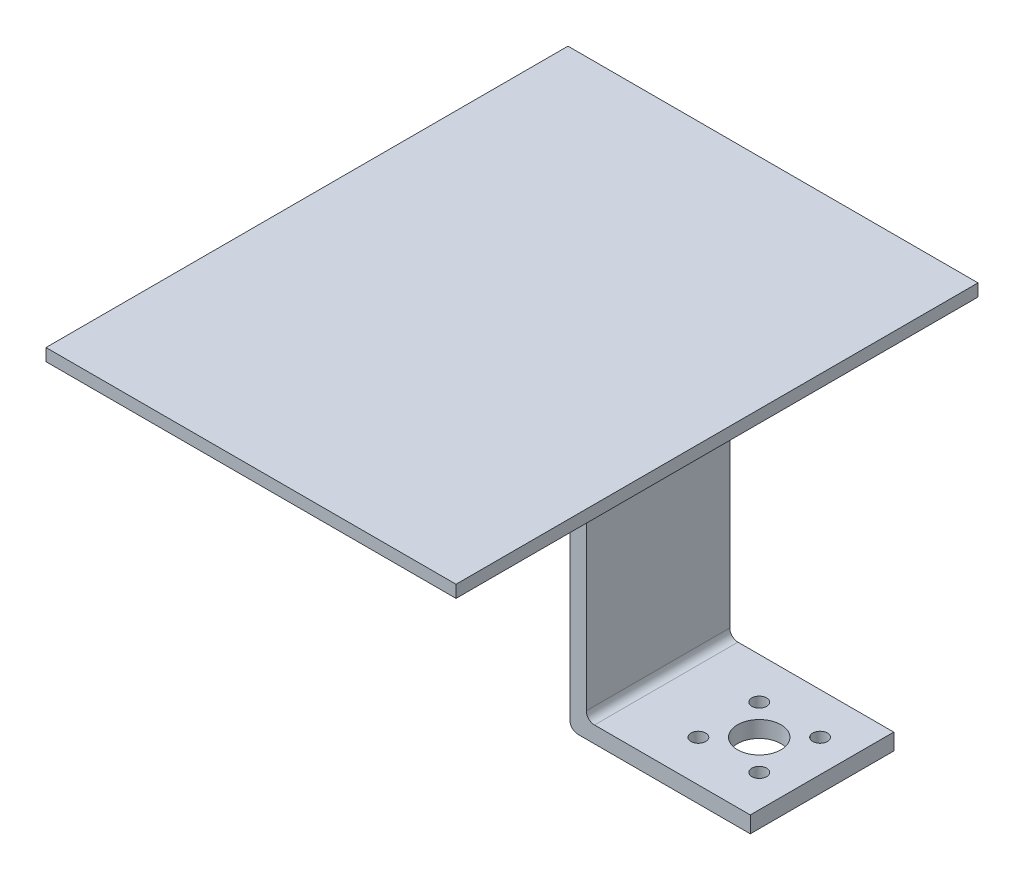
ISO-10303-21;
HEADER;
FILE_DESCRIPTION(('STEP AP214'),'2;1');
FILE_NAME('part.step','',(''),(''),'','','');
FILE_SCHEMA(('AUTOMOTIVE_DESIGN { 1 0 10303 214 1 1 1 1 }'));
ENDSEC;
DATA;
#1=APPLICATION_CONTEXT('core data for automotive mechanical design processes');
#2=APPLICATION_PROTOCOL_DEFINITION('international standard','automotive_design',2000,#1);
#3=PRODUCT_CONTEXT('',#1,'mechanical');
#4=PRODUCT('Part','Part','',(#3));
#5=PRODUCT_RELATED_PRODUCT_CATEGORY('part','',(#4));
#6=PRODUCT_DEFINITION_FORMATION('','',#4);
#7=PRODUCT_DEFINITION_CONTEXT('part definition',#1,'design');
#8=PRODUCT_DEFINITION('design','',#6,#7);
#9=PRODUCT_DEFINITION_SHAPE('','',#8);
#10=(LENGTH_UNIT() NAMED_UNIT(*) SI_UNIT(.MILLI.,.METRE.));
#11=(NAMED_UNIT(*) PLANE_ANGLE_UNIT() SI_UNIT($,.RADIAN.));
#12=(NAMED_UNIT(*) SI_UNIT($,.STERADIAN.) SOLID_ANGLE_UNIT());
#13=UNCERTAINTY_MEASURE_WITH_UNIT(LENGTH_MEASURE(1.E-05),#10,'distance_accuracy_value','');
#14=(GEOMETRIC_REPRESENTATION_CONTEXT(3) GLOBAL_UNCERTAINTY_ASSIGNED_CONTEXT((#13)) GLOBAL_UNIT_ASSIGNED_CONTEXT((#10,
#11,#12)) REPRESENTATION_CONTEXT('',''));
#15=CARTESIAN_POINT('',(0.,0.,0.));
#16=DIRECTION('',(0.,0.,1.));
#17=DIRECTION('',(1.,0.,0.));
#18=AXIS2_PLACEMENT_3D('',#15,#16,#17);
#19=CARTESIAN_POINT('',(35.6108399779155,-60.,17.4962251040256));
#20=DIRECTION('',(-1.,0.,0.));
#21=DIRECTION('',(0.,0.,1.));
#22=AXIS2_PLACEMENT_3D('',#19,#20,#21);
#23=PLANE('',#22);
#24=DIRECTION('',(0.,1.,0.));
#25=VECTOR('',#24,1.);
#26=CARTESIAN_POINT('',(35.6108399779155,-60.,17.4962251040256));
#27=LINE('',#26,#25);
#28=CARTESIAN_POINT('',(35.6108399779155,-54.,17.4962251040256));
#29=VERTEX_POINT('',#28);
#30=CARTESIAN_POINT('',(35.6108399779155,0.,17.4962251040256));
#31=VERTEX_POINT('',#30);
#32=EDGE_CURVE('E183',#29,#31,#27,.T.);
#33=ORIENTED_EDGE('',*,*,#32,.F.);
#34=DIRECTION('',(0.,0.,1.));
#35=VECTOR('',#34,1.);
#36=CARTESIAN_POINT('',(35.6108399779155,-54.,-17.4962251040256));
#37=LINE('',#36,#35);
#38=CARTESIAN_POINT('',(35.6108399779155,-54.,-17.4962251040256));
#39=VERTEX_POINT('',#38);
#40=EDGE_CURVE('E230',#29,#39,#37,.F.);
#41=ORIENTED_EDGE('',*,*,#40,.T.);
#42=DIRECTION('',(0.,1.,0.));
#43=VECTOR('',#42,1.);
#44=CARTESIAN_POINT('',(35.6108399779155,-60.,-17.4962251040256));
#45=LINE('',#44,#43);
#46=CARTESIAN_POINT('',(35.6108399779155,0.,-17.4962251040256));
#47=VERTEX_POINT('',#46);
#48=EDGE_CURVE('E171',#39,#47,#45,.T.);
#49=ORIENTED_EDGE('',*,*,#48,.T.);
#50=DIRECTION('',(0.,0.,1.));
#51=VECTOR('',#50,1.);
#52=CARTESIAN_POINT('',(35.6108399779155,0.,17.4962251040256));
#53=LINE('',#52,#51);
#54=EDGE_CURVE('E168',#47,#31,#53,.T.);
#55=ORIENTED_EDGE('',*,*,#54,.T.);
#56=EDGE_LOOP('',(#33,#41,#49,#55));
#57=FACE_BOUND('',#56,.T.);
#58=ADVANCED_FACE('F33',(#57),#23,.F.);
#59=CARTESIAN_POINT('',(0.,0.,0.));
#60=DIRECTION('',(0.,1.,0.));
#61=DIRECTION('',(0.,0.,1.));
#62=AXIS2_PLACEMENT_3D('',#59,#60,#61);
#63=PLANE('',#62);
#64=DIRECTION('',(0.,0.,-1.));
#65=VECTOR('',#64,1.);
#66=CARTESIAN_POINT('',(50.,0.,-63.6523764971984));
#67=LINE('',#66,#65);
#68=CARTESIAN_POINT('',(50.,0.,63.6523764971983));
#69=VERTEX_POINT('',#68);
#70=CARTESIAN_POINT('',(50.,0.,-63.6523764971984));
#71=VERTEX_POINT('',#70);
#72=EDGE_CURVE('E185',#69,#71,#67,.T.);
#73=ORIENTED_EDGE('',*,*,#72,.F.);
#74=DIRECTION('',(1.,0.,0.));
#75=VECTOR('',#74,1.);
#76=CARTESIAN_POINT('',(-50.,0.,63.6523764971983));
#77=LINE('',#76,#75);
#78=CARTESIAN_POINT('',(-50.,0.,63.6523764971983));
#79=VERTEX_POINT('',#78);
#80=EDGE_CURVE('E190',#79,#69,#77,.T.);
#81=ORIENTED_EDGE('',*,*,#80,.F.);
#82=DIRECTION('',(0.,0.,1.));
#83=VECTOR('',#82,1.);
#84=CARTESIAN_POINT('',(-50.,0.,-63.6523764971984));
#85=LINE('',#84,#83);
#86=CARTESIAN_POINT('',(-50.,0.,-63.6523764971984));
#87=VERTEX_POINT('',#86);
#88=EDGE_CURVE('E201',#87,#79,#85,.T.);
#89=ORIENTED_EDGE('',*,*,#88,.F.);
#90=DIRECTION('',(-1.,0.,0.));
#91=VECTOR('',#90,1.);
#92=CARTESIAN_POINT('',(-50.,0.,-63.6523764971984));
#93=LINE('',#92,#91);
#94=EDGE_CURVE('E199',#71,#87,#93,.T.);
#95=ORIENTED_EDGE('',*,*,#94,.F.);
#96=EDGE_LOOP('',(#73,#81,#89,#95));
#97=FACE_BOUND('',#96,.T.);
#98=DIRECTION('',(1.,0.,0.));
#99=VECTOR('',#98,1.);
#100=CARTESIAN_POINT('',(35.6108399779155,0.,-17.4962251040256));
#101=LINE('',#100,#99);
#102=CARTESIAN_POINT('',(21.6108399779155,0.,-17.4962251040256));
#103=VERTEX_POINT('',#102);
#104=EDGE_CURVE('E141',#103,#47,#101,.T.);
#105=ORIENTED_EDGE('',*,*,#104,.F.);
#106=DIRECTION('',(0.,0.,1.));
#107=VECTOR('',#106,1.);
#108=CARTESIAN_POINT('',(21.6108399779155,0.,17.4962251040256));
#109=LINE('',#108,#107);
#110=CARTESIAN_POINT('',(21.6108399779155,0.,17.4962251040256));
#111=VERTEX_POINT('',#110);
#112=EDGE_CURVE('E218',#103,#111,#109,.T.);
#113=ORIENTED_EDGE('',*,*,#112,.T.);
#114=DIRECTION('',(-1.,0.,0.));
#115=VECTOR('',#114,1.);
#116=CARTESIAN_POINT('',(35.6108399779155,0.,17.4962251040256));
#117=LINE('',#116,#115);
#118=EDGE_CURVE('E174',#31,#111,#117,.T.);
#119=ORIENTED_EDGE('',*,*,#118,.F.);
#120=ORIENTED_EDGE('',*,*,#54,.F.);
#121=EDGE_LOOP('',(#105,#113,#119,#120));
#122=FACE_BOUND('',#121,.T.);
#123=ADVANCED_FACE('F296',(#97,#122),#63,.F.);
#124=CARTESIAN_POINT('',(50.,3.,-63.6523764971984));
#125=DIRECTION('',(-1.,0.,0.));
#126=DIRECTION('',(0.,0.,1.));
#127=AXIS2_PLACEMENT_3D('',#124,#125,#126);
#128=PLANE('',#127);
#129=ORIENTED_EDGE('',*,*,#72,.T.);
#130=DIRECTION('',(0.,-1.,0.));
#131=VECTOR('',#130,1.);
#132=CARTESIAN_POINT('',(50.,3.,-63.6523764971984));
#133=LINE('',#132,#131);
#134=CARTESIAN_POINT('',(50.,3.,-63.6523764971984));
#135=VERTEX_POINT('',#134);
#136=EDGE_CURVE('E212',#135,#71,#133,.T.);
#137=ORIENTED_EDGE('',*,*,#136,.F.);
#138=DIRECTION('',(0.,0.,-1.));
#139=VECTOR('',#138,1.);
#140=CARTESIAN_POINT('',(50.,3.,-63.6523764971984));
#141=LINE('',#140,#139);
#142=CARTESIAN_POINT('',(50.,3.,63.6523764971983));
#143=VERTEX_POINT('',#142);
#144=EDGE_CURVE('E186',#143,#135,#141,.T.);
#145=ORIENTED_EDGE('',*,*,#144,.F.);
#146=DIRECTION('',(0.,-1.,0.));
#147=VECTOR('',#146,1.);
#148=CARTESIAN_POINT('',(50.,3.,63.6523764971983));
#149=LINE('',#148,#147);
#150=EDGE_CURVE('E196',#143,#69,#149,.T.);
#151=ORIENTED_EDGE('',*,*,#150,.T.);
#152=EDGE_LOOP('',(#129,#137,#145,#151));
#153=FACE_BOUND('',#152,.T.);
#154=ADVANCED_FACE('F313',(#153),#128,.F.);
#155=CARTESIAN_POINT('',(-50.,3.,-63.6523764971984));
#156=DIRECTION('',(0.,0.,1.));
#157=DIRECTION('',(1.,0.,0.));
#158=AXIS2_PLACEMENT_3D('',#155,#156,#157);
#159=PLANE('',#158);
#160=ORIENTED_EDGE('',*,*,#94,.T.);
#161=DIRECTION('',(0.,-1.,0.));
#162=VECTOR('',#161,1.);
#163=CARTESIAN_POINT('',(-50.,3.,-63.6523764971984));
#164=LINE('',#163,#162);
#165=CARTESIAN_POINT('',(-50.,3.,-63.6523764971984));
#166=VERTEX_POINT('',#165);
#167=EDGE_CURVE('E209',#166,#87,#164,.T.);
#168=ORIENTED_EDGE('',*,*,#167,.F.);
#169=DIRECTION('',(-1.,0.,0.));
#170=VECTOR('',#169,1.);
#171=CARTESIAN_POINT('',(-50.,3.,-63.6523764971984));
#172=LINE('',#171,#170);
#173=EDGE_CURVE('E189',#135,#166,#172,.T.);
#174=ORIENTED_EDGE('',*,*,#173,.F.);
#175=ORIENTED_EDGE('',*,*,#136,.T.);
#176=EDGE_LOOP('',(#160,#168,#174,#175));
#177=FACE_BOUND('',#176,.T.);
#178=ADVANCED_FACE('F330',(#177),#159,.F.);
#179=CARTESIAN_POINT('',(-50.,3.,-63.6523764971984));
#180=DIRECTION('',(1.,0.,0.));
#181=DIRECTION('',(0.,0.,-1.));
#182=AXIS2_PLACEMENT_3D('',#179,#180,#181);
#183=PLANE('',#182);
#184=ORIENTED_EDGE('',*,*,#88,.T.);
#185=DIRECTION('',(0.,-1.,0.));
#186=VECTOR('',#185,1.);
#187=CARTESIAN_POINT('',(-50.,3.,63.6523764971983));
#188=LINE('',#187,#186);
#189=CARTESIAN_POINT('',(-50.,3.,63.6523764971983));
#190=VERTEX_POINT('',#189);
#191=EDGE_CURVE('E206',#190,#79,#188,.T.);
#192=ORIENTED_EDGE('',*,*,#191,.F.);
#193=DIRECTION('',(0.,0.,1.));
#194=VECTOR('',#193,1.);
#195=CARTESIAN_POINT('',(-50.,3.,-63.6523764971984));
#196=LINE('',#195,#194);
#197=EDGE_CURVE('E192',#166,#190,#196,.T.);
#198=ORIENTED_EDGE('',*,*,#197,.F.);
#199=ORIENTED_EDGE('',*,*,#167,.T.);
#200=EDGE_LOOP('',(#184,#192,#198,#199));
#201=FACE_BOUND('',#200,.T.);
#202=ADVANCED_FACE('F326',(#201),#183,.F.);
#203=CARTESIAN_POINT('',(-50.,3.,63.6523764971983));
#204=DIRECTION('',(0.,0.,-1.));
#205=DIRECTION('',(-1.,0.,0.));
#206=AXIS2_PLACEMENT_3D('',#203,#204,#205);
#207=PLANE('',#206);
#208=ORIENTED_EDGE('',*,*,#80,.T.);
#209=ORIENTED_EDGE('',*,*,#150,.F.);
#210=DIRECTION('',(1.,0.,0.));
#211=VECTOR('',#210,1.);
#212=CARTESIAN_POINT('',(-50.,3.,63.6523764971983));
#213=LINE('',#212,#211);
#214=EDGE_CURVE('E194',#190,#143,#213,.T.);
#215=ORIENTED_EDGE('',*,*,#214,.F.);
#216=ORIENTED_EDGE('',*,*,#191,.T.);
#217=EDGE_LOOP('',(#208,#209,#215,#216));
#218=FACE_BOUND('',#217,.T.);
#219=ADVANCED_FACE('F321',(#218),#207,.F.);
#220=CARTESIAN_POINT('',(0.,3.,0.));
#221=DIRECTION('',(0.,1.,0.));
#222=DIRECTION('',(0.,0.,1.));
#223=AXIS2_PLACEMENT_3D('',#220,#221,#222);
#224=PLANE('',#223);
#225=ORIENTED_EDGE('',*,*,#144,.T.);
#226=ORIENTED_EDGE('',*,*,#173,.T.);
#227=ORIENTED_EDGE('',*,*,#197,.T.);
#228=ORIENTED_EDGE('',*,*,#214,.T.);
#229=EDGE_LOOP('',(#225,#226,#227,#228));
#230=FACE_BOUND('',#229,.T.);
#231=ADVANCED_FACE('F319',(#230),#224,.T.);
#232=CARTESIAN_POINT('',(35.6108399779155,-60.,17.4962251040256));
#233=DIRECTION('',(0.,0.,-1.));
#234=DIRECTION('',(-1.,0.,0.));
#235=AXIS2_PLACEMENT_3D('',#232,#233,#234);
#236=PLANE('',#235);
#237=DIRECTION('',(0.,1.,0.));
#238=VECTOR('',#237,1.);
#239=CARTESIAN_POINT('',(31.6108399779155,-60.,17.4962251040256));
#240=LINE('',#239,#238);
#241=CARTESIAN_POINT('',(31.6108399779155,-58.,17.4962251040256));
#242=VERTEX_POINT('',#241);
#243=CARTESIAN_POINT('',(31.6108399779155,-10.0000000000001,17.4962251040256));
#244=VERTEX_POINT('',#243);
#245=EDGE_CURVE('E181',#242,#244,#240,.T.);
#246=ORIENTED_EDGE('',*,*,#245,.F.);
#247=CARTESIAN_POINT('',(33.6108399779155,-58.,17.4962251040256));
#248=DIRECTION('',(0.,0.,-1.));
#249=DIRECTION('',(-1.,0.,0.));
#250=AXIS2_PLACEMENT_3D('',#247,#248,#249);
#251=CIRCLE('',#250,2.);
#252=CARTESIAN_POINT('',(33.6108399779155,-60.,17.4962251040256));
#253=VERTEX_POINT('',#252);
#254=EDGE_CURVE('E136',#242,#253,#251,.F.);
#255=ORIENTED_EDGE('',*,*,#254,.T.);
#256=DIRECTION('',(-1.,0.,0.));
#257=VECTOR('',#256,1.);
#258=CARTESIAN_POINT('',(35.6108399779155,-60.,17.4962251040256));
#259=LINE('',#258,#257);
#260=CARTESIAN_POINT('',(75.6108399779155,-60.,17.4962251040256));
#261=VERTEX_POINT('',#260);
#262=EDGE_CURVE('E129',#261,#253,#259,.T.);
#263=ORIENTED_EDGE('',*,*,#262,.F.);
#264=DIRECTION('',(0.,-1.,0.));
#265=VECTOR('',#264,1.);
#266=CARTESIAN_POINT('',(75.6108399779155,-60.,17.4962251040256));
#267=LINE('',#266,#265);
#268=CARTESIAN_POINT('',(75.6108399779155,-56.,17.4962251040256));
#269=VERTEX_POINT('',#268);
#270=EDGE_CURVE('E134',#269,#261,#267,.T.);
#271=ORIENTED_EDGE('',*,*,#270,.F.);
#272=DIRECTION('',(-1.,0.,0.));
#273=VECTOR('',#272,1.);
#274=CARTESIAN_POINT('',(75.6108399779155,-56.,17.4962251040256));
#275=LINE('',#274,#273);
#276=CARTESIAN_POINT('',(37.6108399779155,-56.,17.4962251040256));
#277=VERTEX_POINT('',#276);
#278=EDGE_CURVE('E164',#269,#277,#275,.T.);
#279=ORIENTED_EDGE('',*,*,#278,.T.);
#280=CARTESIAN_POINT('',(37.6108399779155,-54.,17.4962251040256));
#281=DIRECTION('',(0.,0.,-1.));
#282=DIRECTION('',(-1.,0.,0.));
#283=AXIS2_PLACEMENT_3D('',#280,#281,#282);
#284=CIRCLE('',#283,2.);
#285=EDGE_CURVE('E42',#277,#29,#284,.T.);
#286=ORIENTED_EDGE('',*,*,#285,.T.);
#287=ORIENTED_EDGE('',*,*,#32,.T.);
#288=ORIENTED_EDGE('',*,*,#118,.T.);
#289=DIRECTION('',(-0.707106781186544,0.707106781186551,0.));
#290=VECTOR('',#289,1.);
#291=CARTESIAN_POINT('',(58.6108399779154,-37.0000000000003,17.4962251040256));
#292=LINE('',#291,#290);
#293=EDGE_CURVE('E224',#111,#244,#292,.F.);
#294=ORIENTED_EDGE('',*,*,#293,.T.);
#295=EDGE_LOOP('',(#246,#255,#263,#271,#279,#286,#287,#288,#294));
#296=FACE_BOUND('',#295,.T.);
#297=ADVANCED_FACE('F131',(#296),#236,.F.);
#298=CARTESIAN_POINT('',(31.6108399779155,-60.,17.4962251040256));
#299=DIRECTION('',(1.,0.,0.));
#300=DIRECTION('',(0.,0.,-1.));
#301=AXIS2_PLACEMENT_3D('',#298,#299,#300);
#302=PLANE('',#301);
#303=DIRECTION('',(0.,1.,0.));
#304=VECTOR('',#303,1.);
#305=CARTESIAN_POINT('',(31.6108399779155,-60.,-17.4962251040256));
#306=LINE('',#305,#304);
#307=CARTESIAN_POINT('',(31.6108399779155,-58.,-17.4962251040256));
#308=VERTEX_POINT('',#307);
#309=CARTESIAN_POINT('',(31.6108399779155,-10.0000000000001,-17.4962251040256));
#310=VERTEX_POINT('',#309);
#311=EDGE_CURVE('E179',#308,#310,#306,.T.);
#312=ORIENTED_EDGE('',*,*,#311,.F.);
#313=DIRECTION('',(0.,0.,-1.));
#314=VECTOR('',#313,1.);
#315=CARTESIAN_POINT('',(31.6108399779155,-58.,17.4962251040256));
#316=LINE('',#315,#314);
#317=EDGE_CURVE('E50',#308,#242,#316,.F.);
#318=ORIENTED_EDGE('',*,*,#317,.T.);
#319=ORIENTED_EDGE('',*,*,#245,.T.);
#320=DIRECTION('',(0.,0.,-1.));
#321=VECTOR('',#320,1.);
#322=CARTESIAN_POINT('',(31.6108399779155,-10.0000000000001,-17.4962251040256));
#323=LINE('',#322,#321);
#324=EDGE_CURVE('E215',#244,#310,#323,.T.);
#325=ORIENTED_EDGE('',*,*,#324,.T.);
#326=EDGE_LOOP('',(#312,#318,#319,#325));
#327=FACE_BOUND('',#326,.T.);
#328=ADVANCED_FACE('F348',(#327),#302,.F.);
#329=CARTESIAN_POINT('',(35.6108399779155,-60.,-17.4962251040256));
#330=DIRECTION('',(0.,0.,1.));
#331=DIRECTION('',(1.,0.,0.));
#332=AXIS2_PLACEMENT_3D('',#329,#330,#331);
#333=PLANE('',#332);
#334=DIRECTION('',(1.,0.,0.));
#335=VECTOR('',#334,1.);
#336=CARTESIAN_POINT('',(35.6108399779155,-60.,-17.4962251040256));
#337=LINE('',#336,#335);
#338=CARTESIAN_POINT('',(33.6108399779155,-60.,-17.4962251040256));
#339=VERTEX_POINT('',#338);
#340=CARTESIAN_POINT('',(75.6108399779155,-60.,-17.4962251040256));
#341=VERTEX_POINT('',#340);
#342=EDGE_CURVE('E140',#339,#341,#337,.T.);
#343=ORIENTED_EDGE('',*,*,#342,.F.);
#344=CARTESIAN_POINT('',(33.6108399779155,-58.,-17.4962251040256));
#345=DIRECTION('',(0.,0.,1.));
#346=DIRECTION('',(1.,0.,0.));
#347=AXIS2_PLACEMENT_3D('',#344,#345,#346);
#348=CIRCLE('',#347,2.);
#349=EDGE_CURVE('E58',#339,#308,#348,.F.);
#350=ORIENTED_EDGE('',*,*,#349,.T.);
#351=ORIENTED_EDGE('',*,*,#311,.T.);
#352=DIRECTION('',(0.707106781186544,-0.707106781186551,0.));
#353=VECTOR('',#352,1.);
#354=CARTESIAN_POINT('',(58.6108399779154,-37.0000000000003,-17.4962251040256));
#355=LINE('',#354,#353);
#356=EDGE_CURVE('E221',#310,#103,#355,.F.);
#357=ORIENTED_EDGE('',*,*,#356,.T.);
#358=ORIENTED_EDGE('',*,*,#104,.T.);
#359=ORIENTED_EDGE('',*,*,#48,.F.);
#360=CARTESIAN_POINT('',(37.6108399779155,-54.,-17.4962251040256));
#361=DIRECTION('',(0.,0.,1.));
#362=DIRECTION('',(1.,0.,0.));
#363=AXIS2_PLACEMENT_3D('',#360,#361,#362);
#364=CIRCLE('',#363,2.);
#365=CARTESIAN_POINT('',(37.6108399779155,-56.,-17.4962251040256));
#366=VERTEX_POINT('',#365);
#367=EDGE_CURVE('E11',#39,#366,#364,.T.);
#368=ORIENTED_EDGE('',*,*,#367,.T.);
#369=DIRECTION('',(-1.,0.,0.));
#370=VECTOR('',#369,1.);
#371=CARTESIAN_POINT('',(75.6108399779155,-56.,-17.4962251040256));
#372=LINE('',#371,#370);
#373=CARTESIAN_POINT('',(75.6108399779155,-56.,-17.4962251040256));
#374=VERTEX_POINT('',#373);
#375=EDGE_CURVE('E166',#374,#366,#372,.T.);
#376=ORIENTED_EDGE('',*,*,#375,.F.);
#377=DIRECTION('',(0.,1.,0.));
#378=VECTOR('',#377,1.);
#379=CARTESIAN_POINT('',(75.6108399779155,-60.,-17.4962251040256));
#380=LINE('',#379,#378);
#381=EDGE_CURVE('E148',#341,#374,#380,.T.);
#382=ORIENTED_EDGE('',*,*,#381,.F.);
#383=EDGE_LOOP('',(#343,#350,#351,#357,#358,#359,#368,#376,#382));
#384=FACE_BOUND('',#383,.T.);
#385=ADVANCED_FACE('F268',(#384),#333,.F.);
#386=CARTESIAN_POINT('',(0.,-60.,0.));
#387=DIRECTION('',(0.,1.,0.));
#388=DIRECTION('',(0.,0.,1.));
#389=AXIS2_PLACEMENT_3D('',#386,#387,#388);
#390=PLANE('',#389);
#391=CARTESIAN_POINT('',(67.7226510499037,-60.,7.42462120245867));
#392=DIRECTION('',(0.,-1.,0.));
#393=DIRECTION('',(0.,0.,-1.));
#394=AXIS2_PLACEMENT_3D('',#391,#392,#393);
#395=CIRCLE('',#394,1.8);
#396=CARTESIAN_POINT('',(67.7226510499037,-60.,5.62462120245867));
#397=VERTEX_POINT('',#396);
#398=EDGE_CURVE('E257',#397,#397,#395,.T.);
#399=ORIENTED_EDGE('',*,*,#398,.F.);
#400=EDGE_LOOP('',(#399));
#401=FACE_BOUND('',#400,.T.);
#402=CARTESIAN_POINT('',(52.8734086449862,-60.,7.42462120245878));
#403=DIRECTION('',(0.,-1.,0.));
#404=DIRECTION('',(0.,0.,-1.));
#405=AXIS2_PLACEMENT_3D('',#402,#403,#404);
#406=CIRCLE('',#405,1.8);
#407=CARTESIAN_POINT('',(52.8734086449862,-60.,5.62462120245878));
#408=VERTEX_POINT('',#407);
#409=EDGE_CURVE('E247',#408,#408,#406,.T.);
#410=ORIENTED_EDGE('',*,*,#409,.F.);
#411=EDGE_LOOP('',(#410));
#412=FACE_BOUND('',#411,.T.);
#413=CARTESIAN_POINT('',(52.8734086449862,-60.,-7.42462120245874));
#414=DIRECTION('',(0.,-1.,0.));
#415=DIRECTION('',(0.,0.,-1.));
#416=AXIS2_PLACEMENT_3D('',#413,#414,#415);
#417=CIRCLE('',#416,1.79999999999999);
#418=CARTESIAN_POINT('',(52.8734086449862,-60.,-9.22462120245873));
#419=VERTEX_POINT('',#418);
#420=EDGE_CURVE('E244',#419,#419,#417,.T.);
#421=ORIENTED_EDGE('',*,*,#420,.F.);
#422=EDGE_LOOP('',(#421));
#423=FACE_BOUND('',#422,.T.);
#424=CARTESIAN_POINT('',(67.7226510499037,-60.,-7.42462120245874));
#425=DIRECTION('',(0.,-1.,0.));
#426=DIRECTION('',(0.,0.,-1.));
#427=AXIS2_PLACEMENT_3D('',#424,#425,#426);
#428=CIRCLE('',#427,1.79999999999999);
#429=CARTESIAN_POINT('',(67.7226510499037,-60.,-9.22462120245873));
#430=VERTEX_POINT('',#429);
#431=EDGE_CURVE('E241',#430,#430,#428,.T.);
#432=ORIENTED_EDGE('',*,*,#431,.F.);
#433=EDGE_LOOP('',(#432));
#434=FACE_BOUND('',#433,.T.);
#435=CARTESIAN_POINT('',(60.2980298474449,-60.,0.));
#436=DIRECTION('',(0.,-1.,0.));
#437=DIRECTION('',(0.,0.,-1.));
#438=AXIS2_PLACEMENT_3D('',#435,#436,#437);
#439=CIRCLE('',#438,5.3);
#440=CARTESIAN_POINT('',(60.2980298474449,-60.,-5.3));
#441=VERTEX_POINT('',#440);
#442=EDGE_CURVE('E157',#441,#441,#439,.T.);
#443=ORIENTED_EDGE('',*,*,#442,.F.);
#444=EDGE_LOOP('',(#443));
#445=FACE_BOUND('',#444,.T.);
#446=ORIENTED_EDGE('',*,*,#262,.T.);
#447=DIRECTION('',(0.,0.,-1.));
#448=VECTOR('',#447,1.);
#449=CARTESIAN_POINT('',(33.6108399779155,-60.,0.));
#450=LINE('',#449,#448);
#451=EDGE_CURVE('E232',#253,#339,#450,.T.);
#452=ORIENTED_EDGE('',*,*,#451,.T.);
#453=ORIENTED_EDGE('',*,*,#342,.T.);
#454=DIRECTION('',(0.,0.,-1.));
#455=VECTOR('',#454,1.);
#456=CARTESIAN_POINT('',(75.6108399779155,-60.,17.4962251040256));
#457=LINE('',#456,#455);
#458=EDGE_CURVE('E144',#261,#341,#457,.T.);
#459=ORIENTED_EDGE('',*,*,#458,.F.);
#460=EDGE_LOOP('',(#446,#452,#453,#459));
#461=FACE_BOUND('',#460,.T.);
#462=ADVANCED_FACE('F145',(#401,#412,#423,#434,#445,#461),#390,.F.);
#463=CARTESIAN_POINT('',(75.6108399779155,-56.,17.4962251040256));
#464=DIRECTION('',(0.,-1.,0.));
#465=DIRECTION('',(0.,0.,-1.));
#466=AXIS2_PLACEMENT_3D('',#463,#464,#465);
#467=PLANE('',#466);
#468=CARTESIAN_POINT('',(67.7226510499037,-56.,7.42462120245867));
#469=DIRECTION('',(0.,-1.,0.));
#470=DIRECTION('',(0.,0.,-1.));
#471=AXIS2_PLACEMENT_3D('',#468,#469,#470);
#472=CIRCLE('',#471,1.8);
#473=CARTESIAN_POINT('',(67.7226510499037,-56.,5.62462120245867));
#474=VERTEX_POINT('',#473);
#475=EDGE_CURVE('E37',#474,#474,#472,.T.);
#476=ORIENTED_EDGE('',*,*,#475,.T.);
#477=EDGE_LOOP('',(#476));
#478=FACE_BOUND('',#477,.T.);
#479=CARTESIAN_POINT('',(52.8734086449862,-56.,7.42462120245878));
#480=DIRECTION('',(0.,-1.,0.));
#481=DIRECTION('',(0.,0.,-1.));
#482=AXIS2_PLACEMENT_3D('',#479,#480,#481);
#483=CIRCLE('',#482,1.8);
#484=CARTESIAN_POINT('',(52.8734086449862,-56.,5.62462120245878));
#485=VERTEX_POINT('',#484);
#486=EDGE_CURVE('E245',#485,#485,#483,.T.);
#487=ORIENTED_EDGE('',*,*,#486,.T.);
#488=EDGE_LOOP('',(#487));
#489=FACE_BOUND('',#488,.T.);
#490=CARTESIAN_POINT('',(52.8734086449862,-56.,-7.42462120245874));
#491=DIRECTION('',(0.,-1.,0.));
#492=DIRECTION('',(0.,0.,-1.));
#493=AXIS2_PLACEMENT_3D('',#490,#491,#492);
#494=CIRCLE('',#493,1.79999999999999);
#495=CARTESIAN_POINT('',(52.8734086449862,-56.,-9.22462120245873));
#496=VERTEX_POINT('',#495);
#497=EDGE_CURVE('E242',#496,#496,#494,.T.);
#498=ORIENTED_EDGE('',*,*,#497,.T.);
#499=EDGE_LOOP('',(#498));
#500=FACE_BOUND('',#499,.T.);
#501=CARTESIAN_POINT('',(67.7226510499037,-56.,-7.42462120245874));
#502=DIRECTION('',(0.,-1.,0.));
#503=DIRECTION('',(0.,0.,-1.));
#504=AXIS2_PLACEMENT_3D('',#501,#502,#503);
#505=CIRCLE('',#504,1.79999999999999);
#506=CARTESIAN_POINT('',(67.7226510499037,-56.,-9.22462120245873));
#507=VERTEX_POINT('',#506);
#508=EDGE_CURVE('E238',#507,#507,#505,.T.);
#509=ORIENTED_EDGE('',*,*,#508,.T.);
#510=EDGE_LOOP('',(#509));
#511=FACE_BOUND('',#510,.T.);
#512=CARTESIAN_POINT('',(60.2980298474449,-56.,0.));
#513=DIRECTION('',(0.,-1.,0.));
#514=DIRECTION('',(0.,0.,-1.));
#515=AXIS2_PLACEMENT_3D('',#512,#513,#514);
#516=CIRCLE('',#515,5.3);
#517=CARTESIAN_POINT('',(60.2980298474449,-56.,-5.3));
#518=VERTEX_POINT('',#517);
#519=EDGE_CURVE('E154',#518,#518,#516,.T.);
#520=ORIENTED_EDGE('',*,*,#519,.T.);
#521=EDGE_LOOP('',(#520));
#522=FACE_BOUND('',#521,.T.);
#523=ORIENTED_EDGE('',*,*,#375,.T.);
#524=DIRECTION('',(0.,0.,1.));
#525=VECTOR('',#524,1.);
#526=CARTESIAN_POINT('',(37.6108399779155,-56.,17.4962251040256));
#527=LINE('',#526,#525);
#528=EDGE_CURVE('E227',#366,#277,#527,.T.);
#529=ORIENTED_EDGE('',*,*,#528,.T.);
#530=ORIENTED_EDGE('',*,*,#278,.F.);
#531=DIRECTION('',(0.,0.,1.));
#532=VECTOR('',#531,1.);
#533=CARTESIAN_POINT('',(75.6108399779155,-56.,17.4962251040256));
#534=LINE('',#533,#532);
#535=EDGE_CURVE('E152',#374,#269,#534,.T.);
#536=ORIENTED_EDGE('',*,*,#535,.F.);
#537=EDGE_LOOP('',(#523,#529,#530,#536));
#538=FACE_BOUND('',#537,.T.);
#539=ADVANCED_FACE('F267',(#478,#489,#500,#511,#522,#538),#467,.F.);
#540=CARTESIAN_POINT('',(75.6108399779155,0.,0.));
#541=DIRECTION('',(-1.,0.,0.));
#542=DIRECTION('',(0.,0.,1.));
#543=AXIS2_PLACEMENT_3D('',#540,#541,#542);
#544=PLANE('',#543);
#545=ORIENTED_EDGE('',*,*,#270,.T.);
#546=ORIENTED_EDGE('',*,*,#458,.T.);
#547=ORIENTED_EDGE('',*,*,#381,.T.);
#548=ORIENTED_EDGE('',*,*,#535,.T.);
#549=EDGE_LOOP('',(#545,#546,#547,#548));
#550=FACE_BOUND('',#549,.T.);
#551=ADVANCED_FACE('F150',(#550),#544,.F.);
#552=CARTESIAN_POINT('',(31.6108399779155,-10.0000000000001,17.4962251040256));
#553=DIRECTION('',(-0.707106781186551,-0.707106781186543,0.));
#554=DIRECTION('',(0.,0.,1.));
#555=AXIS2_PLACEMENT_3D('',#552,#553,#554);
#556=PLANE('',#555);
#557=ORIENTED_EDGE('',*,*,#293,.F.);
#558=ORIENTED_EDGE('',*,*,#112,.F.);
#559=ORIENTED_EDGE('',*,*,#356,.F.);
#560=ORIENTED_EDGE('',*,*,#324,.F.);
#561=EDGE_LOOP('',(#557,#558,#559,#560));
#562=FACE_BOUND('',#561,.T.);
#563=ADVANCED_FACE('F302',(#562),#556,.T.);
#564=CARTESIAN_POINT('',(37.6108399779155,-54.,17.4962251040256));
#565=DIRECTION('',(0.,0.,-1.));
#566=DIRECTION('',(-1.,0.,0.));
#567=AXIS2_PLACEMENT_3D('',#564,#565,#566);
#568=CYLINDRICAL_SURFACE('',#567,2.);
#569=ORIENTED_EDGE('',*,*,#367,.F.);
#570=ORIENTED_EDGE('',*,*,#40,.F.);
#571=ORIENTED_EDGE('',*,*,#285,.F.);
#572=ORIENTED_EDGE('',*,*,#528,.F.);
#573=EDGE_LOOP('',(#569,#570,#571,#572));
#574=FACE_BOUND('',#573,.T.);
#575=ADVANCED_FACE('F288',(#574),#568,.F.);
#576=CARTESIAN_POINT('',(33.6108399779155,-58.,0.));
#577=DIRECTION('',(0.,0.,-1.));
#578=DIRECTION('',(-1.,0.,0.));
#579=AXIS2_PLACEMENT_3D('',#576,#577,#578);
#580=CYLINDRICAL_SURFACE('',#579,2.);
#581=ORIENTED_EDGE('',*,*,#254,.F.);
#582=ORIENTED_EDGE('',*,*,#317,.F.);
#583=ORIENTED_EDGE('',*,*,#349,.F.);
#584=ORIENTED_EDGE('',*,*,#451,.F.);
#585=EDGE_LOOP('',(#581,#582,#583,#584));
#586=FACE_BOUND('',#585,.T.);
#587=ADVANCED_FACE('F35',(#586),#580,.T.);
#588=CARTESIAN_POINT('',(60.2980298474449,-20.,0.));
#589=DIRECTION('',(0.,-1.,0.));
#590=DIRECTION('',(0.,0.,-1.));
#591=AXIS2_PLACEMENT_3D('',#588,#589,#590);
#592=CYLINDRICAL_SURFACE('',#591,5.3);
#593=ORIENTED_EDGE('',*,*,#442,.T.);
#594=EDGE_LOOP('',(#593));
#595=FACE_BOUND('',#594,.T.);
#596=ORIENTED_EDGE('',*,*,#519,.F.);
#597=EDGE_LOOP('',(#596));
#598=FACE_BOUND('',#597,.T.);
#599=ADVANCED_FACE('F274',(#595,#598),#592,.F.);
#600=CARTESIAN_POINT('',(67.7226510499037,-20.,-7.42462120245874));
#601=DIRECTION('',(0.,-1.,0.));
#602=DIRECTION('',(0.,0.,-1.));
#603=AXIS2_PLACEMENT_3D('',#600,#601,#602);
#604=CYLINDRICAL_SURFACE('',#603,1.79999999999999);
#605=ORIENTED_EDGE('',*,*,#431,.T.);
#606=EDGE_LOOP('',(#605));
#607=FACE_BOUND('',#606,.T.);
#608=ORIENTED_EDGE('',*,*,#508,.F.);
#609=EDGE_LOOP('',(#608));
#610=FACE_BOUND('',#609,.T.);
#611=ADVANCED_FACE('F262',(#607,#610),#604,.F.);
#612=CARTESIAN_POINT('',(52.8734086449862,-20.,-7.42462120245874));
#613=DIRECTION('',(0.,-1.,0.));
#614=DIRECTION('',(0.,0.,-1.));
#615=AXIS2_PLACEMENT_3D('',#612,#613,#614);
#616=CYLINDRICAL_SURFACE('',#615,1.79999999999999);
#617=ORIENTED_EDGE('',*,*,#420,.T.);
#618=EDGE_LOOP('',(#617));
#619=FACE_BOUND('',#618,.T.);
#620=ORIENTED_EDGE('',*,*,#497,.F.);
#621=EDGE_LOOP('',(#620));
#622=FACE_BOUND('',#621,.T.);
#623=ADVANCED_FACE('F437',(#619,#622),#616,.F.);
#624=CARTESIAN_POINT('',(52.8734086449862,-20.,7.42462120245878));
#625=DIRECTION('',(0.,-1.,0.));
#626=DIRECTION('',(0.,0.,-1.));
#627=AXIS2_PLACEMENT_3D('',#624,#625,#626);
#628=CYLINDRICAL_SURFACE('',#627,1.8);
#629=ORIENTED_EDGE('',*,*,#409,.T.);
#630=EDGE_LOOP('',(#629));
#631=FACE_BOUND('',#630,.T.);
#632=ORIENTED_EDGE('',*,*,#486,.F.);
#633=EDGE_LOOP('',(#632));
#634=FACE_BOUND('',#633,.T.);
#635=ADVANCED_FACE('F445',(#631,#634),#628,.F.);
#636=CARTESIAN_POINT('',(67.7226510499037,-20.,7.42462120245867));
#637=DIRECTION('',(0.,-1.,0.));
#638=DIRECTION('',(0.,0.,-1.));
#639=AXIS2_PLACEMENT_3D('',#636,#637,#638);
#640=CYLINDRICAL_SURFACE('',#639,1.8);
#641=ORIENTED_EDGE('',*,*,#398,.T.);
#642=EDGE_LOOP('',(#641));
#643=FACE_BOUND('',#642,.T.);
#644=ORIENTED_EDGE('',*,*,#475,.F.);
#645=EDGE_LOOP('',(#644));
#646=FACE_BOUND('',#645,.T.);
#647=ADVANCED_FACE('F455',(#643,#646),#640,.F.);
#648=CLOSED_SHELL('',(#58,#123,#154,#178,#202,#219,#231,#297,#328,#385,#462,#539,#551,#563,#575,
#587,#599,#611,#623,#635,#647));
#649=MANIFOLD_SOLID_BREP('B2',#648);
#650=ADVANCED_BREP_SHAPE_REPRESENTATION('',(#18,#649),#14);
#651=SHAPE_DEFINITION_REPRESENTATION(#9,#650);
ENDSEC;
END-ISO-10303-21;
